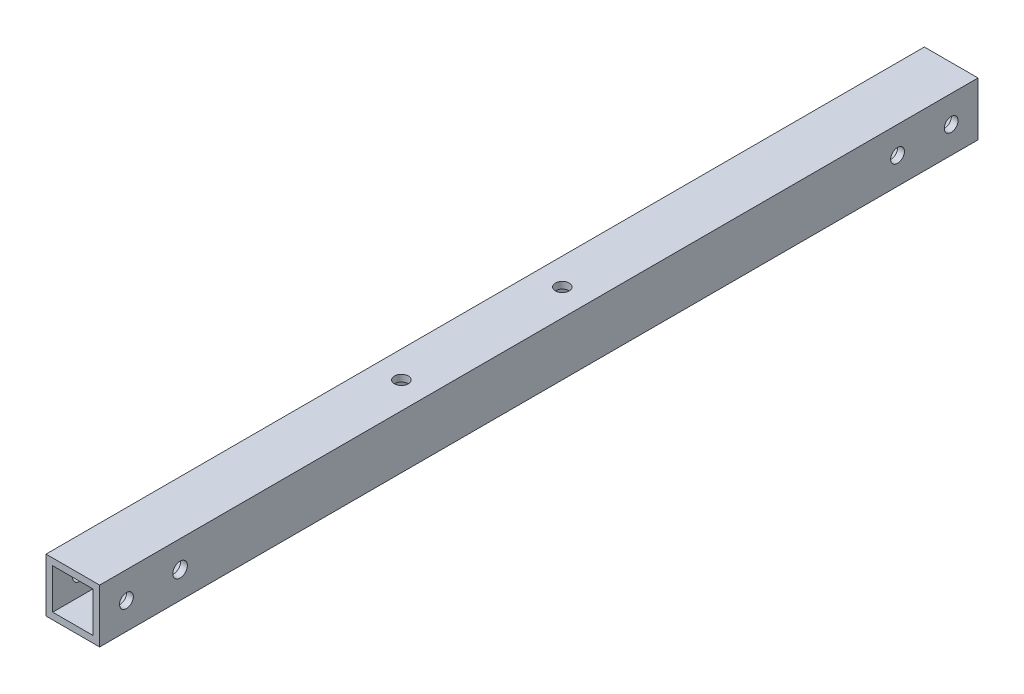
ISO-10303-21;
HEADER;
FILE_DESCRIPTION(('STEP AP214'),'2;1');
FILE_NAME('part.step','',(''),(''),'','','');
FILE_SCHEMA(('AUTOMOTIVE_DESIGN { 1 0 10303 214 1 1 1 1 }'));
ENDSEC;
DATA;
#1=APPLICATION_CONTEXT('core data for automotive mechanical design processes');
#2=APPLICATION_PROTOCOL_DEFINITION('international standard','automotive_design',2000,#1);
#3=PRODUCT_CONTEXT('',#1,'mechanical');
#4=PRODUCT('Part','Part','',(#3));
#5=PRODUCT_RELATED_PRODUCT_CATEGORY('part','',(#4));
#6=PRODUCT_DEFINITION_FORMATION('','',#4);
#7=PRODUCT_DEFINITION_CONTEXT('part definition',#1,'design');
#8=PRODUCT_DEFINITION('design','',#6,#7);
#9=PRODUCT_DEFINITION_SHAPE('','',#8);
#10=(LENGTH_UNIT() NAMED_UNIT(*) SI_UNIT(.MILLI.,.METRE.));
#11=(NAMED_UNIT(*) PLANE_ANGLE_UNIT() SI_UNIT($,.RADIAN.));
#12=(NAMED_UNIT(*) SI_UNIT($,.STERADIAN.) SOLID_ANGLE_UNIT());
#13=UNCERTAINTY_MEASURE_WITH_UNIT(LENGTH_MEASURE(1.E-05),#10,'distance_accuracy_value','');
#14=(GEOMETRIC_REPRESENTATION_CONTEXT(3) GLOBAL_UNCERTAINTY_ASSIGNED_CONTEXT((#13)) GLOBAL_UNIT_ASSIGNED_CONTEXT((#10,
#11,#12)) REPRESENTATION_CONTEXT('',''));
#15=CARTESIAN_POINT('',(0.,0.,0.));
#16=DIRECTION('',(0.,0.,1.));
#17=DIRECTION('',(1.,0.,0.));
#18=AXIS2_PLACEMENT_3D('',#15,#16,#17);
#19=CARTESIAN_POINT('',(0.,0.,415.925));
#20=DIRECTION('',(0.,0.,-1.));
#21=DIRECTION('',(-1.,0.,0.));
#22=AXIS2_PLACEMENT_3D('',#19,#20,#21);
#23=PLANE('',#22);
#24=DIRECTION('',(0.,1.,0.));
#25=VECTOR('',#24,1.);
#26=CARTESIAN_POINT('',(12.7,-12.7,415.925));
#27=LINE('',#26,#25);
#28=CARTESIAN_POINT('',(12.7,-12.7,415.925));
#29=VERTEX_POINT('',#28);
#30=CARTESIAN_POINT('',(12.7,12.7,415.925));
#31=VERTEX_POINT('',#30);
#32=EDGE_CURVE('E139',#29,#31,#27,.T.);
#33=ORIENTED_EDGE('',*,*,#32,.T.);
#34=DIRECTION('',(-1.,0.,0.));
#35=VECTOR('',#34,1.);
#36=CARTESIAN_POINT('',(-12.7,12.7,415.925));
#37=LINE('',#36,#35);
#38=CARTESIAN_POINT('',(-12.7,12.7,415.925));
#39=VERTEX_POINT('',#38);
#40=EDGE_CURVE('E142',#31,#39,#37,.T.);
#41=ORIENTED_EDGE('',*,*,#40,.T.);
#42=DIRECTION('',(0.,-1.,0.));
#43=VECTOR('',#42,1.);
#44=CARTESIAN_POINT('',(-12.7,-12.7,415.925));
#45=LINE('',#44,#43);
#46=CARTESIAN_POINT('',(-12.7,-12.7,415.925));
#47=VERTEX_POINT('',#46);
#48=EDGE_CURVE('E145',#39,#47,#45,.T.);
#49=ORIENTED_EDGE('',*,*,#48,.T.);
#50=DIRECTION('',(1.,0.,0.));
#51=VECTOR('',#50,1.);
#52=CARTESIAN_POINT('',(-12.7,-12.7,415.925));
#53=LINE('',#52,#51);
#54=EDGE_CURVE('E147',#47,#29,#53,.T.);
#55=ORIENTED_EDGE('',*,*,#54,.T.);
#56=EDGE_LOOP('',(#33,#41,#49,#55));
#57=FACE_BOUND('',#56,.T.);
#58=DIRECTION('',(0.,-1.,0.));
#59=VECTOR('',#58,1.);
#60=CARTESIAN_POINT('',(-9.525,-9.525,415.925));
#61=LINE('',#60,#59);
#62=CARTESIAN_POINT('',(-9.525,9.525,415.925));
#63=VERTEX_POINT('',#62);
#64=CARTESIAN_POINT('',(-9.525,-9.525,415.925));
#65=VERTEX_POINT('',#64);
#66=EDGE_CURVE('E101',#63,#65,#61,.T.);
#67=ORIENTED_EDGE('',*,*,#66,.F.);
#68=DIRECTION('',(-1.,0.,0.));
#69=VECTOR('',#68,1.);
#70=CARTESIAN_POINT('',(-9.525,9.525,415.925));
#71=LINE('',#70,#69);
#72=CARTESIAN_POINT('',(9.525,9.525,415.925));
#73=VERTEX_POINT('',#72);
#74=EDGE_CURVE('E123',#73,#63,#71,.T.);
#75=ORIENTED_EDGE('',*,*,#74,.F.);
#76=DIRECTION('',(0.,1.,0.));
#77=VECTOR('',#76,1.);
#78=CARTESIAN_POINT('',(9.525,-9.525,415.925));
#79=LINE('',#78,#77);
#80=CARTESIAN_POINT('',(9.525,-9.525,415.925));
#81=VERTEX_POINT('',#80);
#82=EDGE_CURVE('E121',#81,#73,#79,.T.);
#83=ORIENTED_EDGE('',*,*,#82,.F.);
#84=DIRECTION('',(1.,0.,0.));
#85=VECTOR('',#84,1.);
#86=CARTESIAN_POINT('',(-9.525,-9.525,415.925));
#87=LINE('',#86,#85);
#88=EDGE_CURVE('E109',#65,#81,#87,.T.);
#89=ORIENTED_EDGE('',*,*,#88,.F.);
#90=EDGE_LOOP('',(#67,#75,#83,#89));
#91=FACE_BOUND('',#90,.T.);
#92=ADVANCED_FACE('F34',(#57,#91),#23,.F.);
#93=CARTESIAN_POINT('',(0.,0.,0.));
#94=DIRECTION('',(0.,0.,-1.));
#95=DIRECTION('',(-1.,0.,0.));
#96=AXIS2_PLACEMENT_3D('',#93,#94,#95);
#97=PLANE('',#96);
#98=DIRECTION('',(0.,1.,0.));
#99=VECTOR('',#98,1.);
#100=CARTESIAN_POINT('',(12.7,-12.7,0.));
#101=LINE('',#100,#99);
#102=CARTESIAN_POINT('',(12.7,-12.7,0.));
#103=VERTEX_POINT('',#102);
#104=CARTESIAN_POINT('',(12.7,12.7,0.));
#105=VERTEX_POINT('',#104);
#106=EDGE_CURVE('E117',#103,#105,#101,.T.);
#107=ORIENTED_EDGE('',*,*,#106,.F.);
#108=DIRECTION('',(1.,0.,0.));
#109=VECTOR('',#108,1.);
#110=CARTESIAN_POINT('',(-12.7,-12.7,0.));
#111=LINE('',#110,#109);
#112=CARTESIAN_POINT('',(-12.7,-12.7,0.));
#113=VERTEX_POINT('',#112);
#114=EDGE_CURVE('E143',#113,#103,#111,.T.);
#115=ORIENTED_EDGE('',*,*,#114,.F.);
#116=DIRECTION('',(0.,-1.,0.));
#117=VECTOR('',#116,1.);
#118=CARTESIAN_POINT('',(-12.7,-12.7,0.));
#119=LINE('',#118,#117);
#120=CARTESIAN_POINT('',(-12.7,12.7,0.));
#121=VERTEX_POINT('',#120);
#122=EDGE_CURVE('E154',#121,#113,#119,.T.);
#123=ORIENTED_EDGE('',*,*,#122,.F.);
#124=DIRECTION('',(-1.,0.,0.));
#125=VECTOR('',#124,1.);
#126=CARTESIAN_POINT('',(-12.7,12.7,0.));
#127=LINE('',#126,#125);
#128=EDGE_CURVE('E152',#105,#121,#127,.T.);
#129=ORIENTED_EDGE('',*,*,#128,.F.);
#130=EDGE_LOOP('',(#107,#115,#123,#129));
#131=FACE_BOUND('',#130,.T.);
#132=DIRECTION('',(-1.,0.,0.));
#133=VECTOR('',#132,1.);
#134=CARTESIAN_POINT('',(-9.525,9.525,0.));
#135=LINE('',#134,#133);
#136=CARTESIAN_POINT('',(9.525,9.525,0.));
#137=VERTEX_POINT('',#136);
#138=CARTESIAN_POINT('',(-9.525,9.525,0.));
#139=VERTEX_POINT('',#138);
#140=EDGE_CURVE('E110',#137,#139,#135,.T.);
#141=ORIENTED_EDGE('',*,*,#140,.T.);
#142=DIRECTION('',(0.,-1.,0.));
#143=VECTOR('',#142,1.);
#144=CARTESIAN_POINT('',(-9.525,-9.525,0.));
#145=LINE('',#144,#143);
#146=CARTESIAN_POINT('',(-9.525,-9.525,0.));
#147=VERTEX_POINT('',#146);
#148=EDGE_CURVE('E59',#139,#147,#145,.T.);
#149=ORIENTED_EDGE('',*,*,#148,.T.);
#150=DIRECTION('',(1.,0.,0.));
#151=VECTOR('',#150,1.);
#152=CARTESIAN_POINT('',(-9.525,-9.525,0.));
#153=LINE('',#152,#151);
#154=CARTESIAN_POINT('',(9.525,-9.525,0.));
#155=VERTEX_POINT('',#154);
#156=EDGE_CURVE('E116',#147,#155,#153,.T.);
#157=ORIENTED_EDGE('',*,*,#156,.T.);
#158=DIRECTION('',(0.,1.,0.));
#159=VECTOR('',#158,1.);
#160=CARTESIAN_POINT('',(9.525,-9.525,0.));
#161=LINE('',#160,#159);
#162=EDGE_CURVE('E131',#155,#137,#161,.T.);
#163=ORIENTED_EDGE('',*,*,#162,.T.);
#164=EDGE_LOOP('',(#141,#149,#157,#163));
#165=FACE_BOUND('',#164,.T.);
#166=ADVANCED_FACE('F237',(#131,#165),#97,.T.);
#167=CARTESIAN_POINT('',(12.7,-12.7,415.925));
#168=DIRECTION('',(-1.,0.,0.));
#169=DIRECTION('',(0.,0.,1.));
#170=AXIS2_PLACEMENT_3D('',#167,#168,#169);
#171=PLANE('',#170);
#172=CARTESIAN_POINT('',(12.7,0.,377.825));
#173=DIRECTION('',(1.,0.,0.));
#174=DIRECTION('',(0.,0.,-1.));
#175=AXIS2_PLACEMENT_3D('',#172,#173,#174);
#176=CIRCLE('',#175,3.4544);
#177=CARTESIAN_POINT('',(12.7,0.,374.3706));
#178=VERTEX_POINT('',#177);
#179=EDGE_CURVE('E187',#178,#178,#176,.T.);
#180=ORIENTED_EDGE('',*,*,#179,.F.);
#181=EDGE_LOOP('',(#180));
#182=FACE_BOUND('',#181,.T.);
#183=CARTESIAN_POINT('',(12.7,0.,403.225));
#184=DIRECTION('',(1.,0.,0.));
#185=DIRECTION('',(0.,0.,-1.));
#186=AXIS2_PLACEMENT_3D('',#183,#184,#185);
#187=CIRCLE('',#186,3.26389999999999);
#188=CARTESIAN_POINT('',(12.7,0.,399.9611));
#189=VERTEX_POINT('',#188);
#190=EDGE_CURVE('E184',#189,#189,#187,.T.);
#191=ORIENTED_EDGE('',*,*,#190,.F.);
#192=EDGE_LOOP('',(#191));
#193=FACE_BOUND('',#192,.T.);
#194=CARTESIAN_POINT('',(12.7,0.,12.7));
#195=DIRECTION('',(1.,0.,0.));
#196=DIRECTION('',(0.,0.,-1.));
#197=AXIS2_PLACEMENT_3D('',#194,#195,#196);
#198=CIRCLE('',#197,3.26389999999999);
#199=CARTESIAN_POINT('',(12.7,0.,9.43610000000001));
#200=VERTEX_POINT('',#199);
#201=EDGE_CURVE('E202',#200,#200,#198,.T.);
#202=ORIENTED_EDGE('',*,*,#201,.F.);
#203=EDGE_LOOP('',(#202));
#204=FACE_BOUND('',#203,.T.);
#205=CARTESIAN_POINT('',(12.7,0.,38.1));
#206=DIRECTION('',(1.,0.,0.));
#207=DIRECTION('',(0.,0.,-1.));
#208=AXIS2_PLACEMENT_3D('',#205,#206,#207);
#209=CIRCLE('',#208,3.26389999999999);
#210=CARTESIAN_POINT('',(12.7,0.,34.8361));
#211=VERTEX_POINT('',#210);
#212=EDGE_CURVE('E209',#211,#211,#209,.T.);
#213=ORIENTED_EDGE('',*,*,#212,.F.);
#214=EDGE_LOOP('',(#213));
#215=FACE_BOUND('',#214,.T.);
#216=ORIENTED_EDGE('',*,*,#106,.T.);
#217=DIRECTION('',(0.,0.,-1.));
#218=VECTOR('',#217,1.);
#219=CARTESIAN_POINT('',(12.7,12.7,415.925));
#220=LINE('',#219,#218);
#221=EDGE_CURVE('E11',#31,#105,#220,.T.);
#222=ORIENTED_EDGE('',*,*,#221,.F.);
#223=ORIENTED_EDGE('',*,*,#32,.F.);
#224=DIRECTION('',(0.,0.,-1.));
#225=VECTOR('',#224,1.);
#226=CARTESIAN_POINT('',(12.7,-12.7,415.925));
#227=LINE('',#226,#225);
#228=EDGE_CURVE('E149',#29,#103,#227,.T.);
#229=ORIENTED_EDGE('',*,*,#228,.T.);
#230=EDGE_LOOP('',(#216,#222,#223,#229));
#231=FACE_BOUND('',#230,.T.);
#232=ADVANCED_FACE('F36',(#182,#193,#204,#215,#231),#171,.F.);
#233=CARTESIAN_POINT('',(-12.7,12.7,415.925));
#234=DIRECTION('',(0.,-1.,0.));
#235=DIRECTION('',(0.,0.,-1.));
#236=AXIS2_PLACEMENT_3D('',#233,#234,#235);
#237=PLANE('',#236);
#238=CARTESIAN_POINT('',(0.,12.7,184.15));
#239=DIRECTION('',(0.,1.,0.));
#240=DIRECTION('',(0.,0.,1.));
#241=AXIS2_PLACEMENT_3D('',#238,#239,#240);
#242=CIRCLE('',#241,3.2639);
#243=CARTESIAN_POINT('',(0.,12.7,187.4139));
#244=VERTEX_POINT('',#243);
#245=EDGE_CURVE('E256',#244,#244,#242,.T.);
#246=ORIENTED_EDGE('',*,*,#245,.F.);
#247=EDGE_LOOP('',(#246));
#248=FACE_BOUND('',#247,.T.);
#249=CARTESIAN_POINT('',(0.,12.7,260.35));
#250=DIRECTION('',(0.,1.,0.));
#251=DIRECTION('',(0.,0.,1.));
#252=AXIS2_PLACEMENT_3D('',#249,#250,#251);
#253=CIRCLE('',#252,3.2639);
#254=CARTESIAN_POINT('',(0.,12.7,263.6139));
#255=VERTEX_POINT('',#254);
#256=EDGE_CURVE('E260',#255,#255,#253,.T.);
#257=ORIENTED_EDGE('',*,*,#256,.F.);
#258=EDGE_LOOP('',(#257));
#259=FACE_BOUND('',#258,.T.);
#260=ORIENTED_EDGE('',*,*,#128,.T.);
#261=DIRECTION('',(0.,0.,-1.));
#262=VECTOR('',#261,1.);
#263=CARTESIAN_POINT('',(-12.7,12.7,415.925));
#264=LINE('',#263,#262);
#265=EDGE_CURVE('E43',#39,#121,#264,.T.);
#266=ORIENTED_EDGE('',*,*,#265,.F.);
#267=ORIENTED_EDGE('',*,*,#40,.F.);
#268=ORIENTED_EDGE('',*,*,#221,.T.);
#269=EDGE_LOOP('',(#260,#266,#267,#268));
#270=FACE_BOUND('',#269,.T.);
#271=ADVANCED_FACE('F246',(#248,#259,#270),#237,.F.);
#272=CARTESIAN_POINT('',(-12.7,-12.7,415.925));
#273=DIRECTION('',(1.,0.,0.));
#274=DIRECTION('',(0.,0.,-1.));
#275=AXIS2_PLACEMENT_3D('',#272,#273,#274);
#276=PLANE('',#275);
#277=CARTESIAN_POINT('',(-12.7,0.,377.825));
#278=DIRECTION('',(1.,0.,0.));
#279=DIRECTION('',(0.,0.,-1.));
#280=AXIS2_PLACEMENT_3D('',#277,#278,#279);
#281=CIRCLE('',#280,3.45439999999999);
#282=CARTESIAN_POINT('',(-12.7,0.,374.3706));
#283=VERTEX_POINT('',#282);
#284=EDGE_CURVE('E180',#283,#283,#281,.T.);
#285=ORIENTED_EDGE('',*,*,#284,.T.);
#286=EDGE_LOOP('',(#285));
#287=FACE_BOUND('',#286,.T.);
#288=CARTESIAN_POINT('',(-12.7,0.,403.225));
#289=DIRECTION('',(1.,0.,0.));
#290=DIRECTION('',(0.,0.,-1.));
#291=AXIS2_PLACEMENT_3D('',#288,#289,#290);
#292=CIRCLE('',#291,3.26389999999998);
#293=CARTESIAN_POINT('',(-12.7,0.,399.9611));
#294=VERTEX_POINT('',#293);
#295=EDGE_CURVE('E176',#294,#294,#292,.T.);
#296=ORIENTED_EDGE('',*,*,#295,.T.);
#297=EDGE_LOOP('',(#296));
#298=FACE_BOUND('',#297,.T.);
#299=CARTESIAN_POINT('',(-12.7,0.,12.7));
#300=DIRECTION('',(1.,0.,0.));
#301=DIRECTION('',(0.,0.,-1.));
#302=AXIS2_PLACEMENT_3D('',#299,#300,#301);
#303=CIRCLE('',#302,3.26389999999998);
#304=CARTESIAN_POINT('',(-12.7,0.,9.43610000000002));
#305=VERTEX_POINT('',#304);
#306=EDGE_CURVE('E172',#305,#305,#303,.T.);
#307=ORIENTED_EDGE('',*,*,#306,.T.);
#308=EDGE_LOOP('',(#307));
#309=FACE_BOUND('',#308,.T.);
#310=CARTESIAN_POINT('',(-12.7,0.,38.1));
#311=DIRECTION('',(1.,0.,0.));
#312=DIRECTION('',(0.,0.,-1.));
#313=AXIS2_PLACEMENT_3D('',#310,#311,#312);
#314=CIRCLE('',#313,3.26389999999998);
#315=CARTESIAN_POINT('',(-12.7,0.,34.8361));
#316=VERTEX_POINT('',#315);
#317=EDGE_CURVE('E167',#316,#316,#314,.T.);
#318=ORIENTED_EDGE('',*,*,#317,.T.);
#319=EDGE_LOOP('',(#318));
#320=FACE_BOUND('',#319,.T.);
#321=ORIENTED_EDGE('',*,*,#122,.T.);
#322=DIRECTION('',(0.,0.,-1.));
#323=VECTOR('',#322,1.);
#324=CARTESIAN_POINT('',(-12.7,-12.7,415.925));
#325=LINE('',#324,#323);
#326=EDGE_CURVE('E159',#47,#113,#325,.T.);
#327=ORIENTED_EDGE('',*,*,#326,.F.);
#328=ORIENTED_EDGE('',*,*,#48,.F.);
#329=ORIENTED_EDGE('',*,*,#265,.T.);
#330=EDGE_LOOP('',(#321,#327,#328,#329));
#331=FACE_BOUND('',#330,.T.);
#332=ADVANCED_FACE('F230',(#287,#298,#309,#320,#331),#276,.F.);
#333=CARTESIAN_POINT('',(-12.7,-12.7,415.925));
#334=DIRECTION('',(0.,1.,0.));
#335=DIRECTION('',(0.,0.,1.));
#336=AXIS2_PLACEMENT_3D('',#333,#334,#335);
#337=PLANE('',#336);
#338=CARTESIAN_POINT('',(0.,-12.7,184.15));
#339=DIRECTION('',(0.,1.,0.));
#340=DIRECTION('',(0.,0.,1.));
#341=AXIS2_PLACEMENT_3D('',#338,#339,#340);
#342=CIRCLE('',#341,3.26389999999999);
#343=CARTESIAN_POINT('',(0.,-12.7,187.4139));
#344=VERTEX_POINT('',#343);
#345=EDGE_CURVE('E321',#344,#344,#342,.T.);
#346=ORIENTED_EDGE('',*,*,#345,.T.);
#347=EDGE_LOOP('',(#346));
#348=FACE_BOUND('',#347,.T.);
#349=CARTESIAN_POINT('',(0.,-12.7,260.35));
#350=DIRECTION('',(0.,1.,0.));
#351=DIRECTION('',(0.,0.,1.));
#352=AXIS2_PLACEMENT_3D('',#349,#350,#351);
#353=CIRCLE('',#352,3.26389999999999);
#354=CARTESIAN_POINT('',(0.,-12.7,263.6139));
#355=VERTEX_POINT('',#354);
#356=EDGE_CURVE('E330',#355,#355,#353,.T.);
#357=ORIENTED_EDGE('',*,*,#356,.T.);
#358=EDGE_LOOP('',(#357));
#359=FACE_BOUND('',#358,.T.);
#360=ORIENTED_EDGE('',*,*,#114,.T.);
#361=ORIENTED_EDGE('',*,*,#228,.F.);
#362=ORIENTED_EDGE('',*,*,#54,.F.);
#363=ORIENTED_EDGE('',*,*,#326,.T.);
#364=EDGE_LOOP('',(#360,#361,#362,#363));
#365=FACE_BOUND('',#364,.T.);
#366=ADVANCED_FACE('F220',(#348,#359,#365),#337,.F.);
#367=CARTESIAN_POINT('',(-9.525,-9.525,415.925));
#368=DIRECTION('',(1.,0.,0.));
#369=DIRECTION('',(0.,0.,-1.));
#370=AXIS2_PLACEMENT_3D('',#367,#368,#369);
#371=PLANE('',#370);
#372=CARTESIAN_POINT('',(-9.525,0.,377.825));
#373=DIRECTION('',(1.,0.,0.));
#374=DIRECTION('',(0.,0.,-1.));
#375=AXIS2_PLACEMENT_3D('',#372,#373,#374);
#376=CIRCLE('',#375,3.4544);
#377=CARTESIAN_POINT('',(-9.525,0.,374.3706));
#378=VERTEX_POINT('',#377);
#379=EDGE_CURVE('E179',#378,#378,#376,.T.);
#380=ORIENTED_EDGE('',*,*,#379,.F.);
#381=EDGE_LOOP('',(#380));
#382=FACE_BOUND('',#381,.T.);
#383=CARTESIAN_POINT('',(-9.525,0.,403.225));
#384=DIRECTION('',(1.,0.,0.));
#385=DIRECTION('',(0.,0.,-1.));
#386=AXIS2_PLACEMENT_3D('',#383,#384,#385);
#387=CIRCLE('',#386,3.26389999999999);
#388=CARTESIAN_POINT('',(-9.525,0.,399.9611));
#389=VERTEX_POINT('',#388);
#390=EDGE_CURVE('E175',#389,#389,#387,.T.);
#391=ORIENTED_EDGE('',*,*,#390,.F.);
#392=EDGE_LOOP('',(#391));
#393=FACE_BOUND('',#392,.T.);
#394=CARTESIAN_POINT('',(-9.525,0.,12.7));
#395=DIRECTION('',(1.,0.,0.));
#396=DIRECTION('',(0.,0.,-1.));
#397=AXIS2_PLACEMENT_3D('',#394,#395,#396);
#398=CIRCLE('',#397,3.26389999999999);
#399=CARTESIAN_POINT('',(-9.525,0.,9.43610000000001));
#400=VERTEX_POINT('',#399);
#401=EDGE_CURVE('E171',#400,#400,#398,.T.);
#402=ORIENTED_EDGE('',*,*,#401,.F.);
#403=EDGE_LOOP('',(#402));
#404=FACE_BOUND('',#403,.T.);
#405=CARTESIAN_POINT('',(-9.525,0.,38.1));
#406=DIRECTION('',(1.,0.,0.));
#407=DIRECTION('',(0.,0.,-1.));
#408=AXIS2_PLACEMENT_3D('',#405,#406,#407);
#409=CIRCLE('',#408,3.26389999999999);
#410=CARTESIAN_POINT('',(-9.525,0.,34.8361));
#411=VERTEX_POINT('',#410);
#412=EDGE_CURVE('E129',#411,#411,#409,.T.);
#413=ORIENTED_EDGE('',*,*,#412,.F.);
#414=EDGE_LOOP('',(#413));
#415=FACE_BOUND('',#414,.T.);
#416=ORIENTED_EDGE('',*,*,#148,.F.);
#417=DIRECTION('',(0.,0.,-1.));
#418=VECTOR('',#417,1.);
#419=CARTESIAN_POINT('',(-9.525,9.525,415.925));
#420=LINE('',#419,#418);
#421=EDGE_CURVE('E105',#63,#139,#420,.T.);
#422=ORIENTED_EDGE('',*,*,#421,.F.);
#423=ORIENTED_EDGE('',*,*,#66,.T.);
#424=DIRECTION('',(0.,0.,-1.));
#425=VECTOR('',#424,1.);
#426=CARTESIAN_POINT('',(-9.525,-9.525,415.925));
#427=LINE('',#426,#425);
#428=EDGE_CURVE('E104',#65,#147,#427,.T.);
#429=ORIENTED_EDGE('',*,*,#428,.T.);
#430=EDGE_LOOP('',(#416,#422,#423,#429));
#431=FACE_BOUND('',#430,.T.);
#432=ADVANCED_FACE('F103',(#382,#393,#404,#415,#431),#371,.T.);
#433=CARTESIAN_POINT('',(-9.525,-9.525,415.925));
#434=DIRECTION('',(0.,1.,0.));
#435=DIRECTION('',(0.,0.,1.));
#436=AXIS2_PLACEMENT_3D('',#433,#434,#435);
#437=PLANE('',#436);
#438=CARTESIAN_POINT('',(0.,-9.525,184.15));
#439=DIRECTION('',(0.,1.,0.));
#440=DIRECTION('',(0.,0.,1.));
#441=AXIS2_PLACEMENT_3D('',#438,#439,#440);
#442=CIRCLE('',#441,3.2639);
#443=CARTESIAN_POINT('',(0.,-9.525,187.4139));
#444=VERTEX_POINT('',#443);
#445=EDGE_CURVE('E326',#444,#444,#442,.T.);
#446=ORIENTED_EDGE('',*,*,#445,.F.);
#447=EDGE_LOOP('',(#446));
#448=FACE_BOUND('',#447,.T.);
#449=CARTESIAN_POINT('',(0.,-9.525,260.35));
#450=DIRECTION('',(0.,1.,0.));
#451=DIRECTION('',(0.,0.,1.));
#452=AXIS2_PLACEMENT_3D('',#449,#450,#451);
#453=CIRCLE('',#452,3.2639);
#454=CARTESIAN_POINT('',(0.,-9.525,263.6139));
#455=VERTEX_POINT('',#454);
#456=EDGE_CURVE('E333',#455,#455,#453,.T.);
#457=ORIENTED_EDGE('',*,*,#456,.F.);
#458=EDGE_LOOP('',(#457));
#459=FACE_BOUND('',#458,.T.);
#460=ORIENTED_EDGE('',*,*,#156,.F.);
#461=ORIENTED_EDGE('',*,*,#428,.F.);
#462=ORIENTED_EDGE('',*,*,#88,.T.);
#463=DIRECTION('',(0.,0.,-1.));
#464=VECTOR('',#463,1.);
#465=CARTESIAN_POINT('',(9.525,-9.525,415.925));
#466=LINE('',#465,#464);
#467=EDGE_CURVE('E118',#81,#155,#466,.T.);
#468=ORIENTED_EDGE('',*,*,#467,.T.);
#469=EDGE_LOOP('',(#460,#461,#462,#468));
#470=FACE_BOUND('',#469,.T.);
#471=ADVANCED_FACE('F113',(#448,#459,#470),#437,.T.);
#472=CARTESIAN_POINT('',(9.525,-9.525,415.925));
#473=DIRECTION('',(-1.,0.,0.));
#474=DIRECTION('',(0.,-1.,0.));
#475=AXIS2_PLACEMENT_3D('',#472,#473,#474);
#476=PLANE('',#475);
#477=CARTESIAN_POINT('',(9.525,0.,377.825));
#478=DIRECTION('',(-1.,0.,0.));
#479=DIRECTION('',(0.,-1.,0.));
#480=AXIS2_PLACEMENT_3D('',#477,#478,#479);
#481=CIRCLE('',#480,3.4544);
#482=CARTESIAN_POINT('',(9.525,-3.4544,377.825));
#483=VERTEX_POINT('',#482);
#484=EDGE_CURVE('E177',#483,#483,#481,.T.);
#485=ORIENTED_EDGE('',*,*,#484,.F.);
#486=EDGE_LOOP('',(#485));
#487=FACE_BOUND('',#486,.T.);
#488=CARTESIAN_POINT('',(9.525,0.,403.225));
#489=DIRECTION('',(-1.,0.,0.));
#490=DIRECTION('',(0.,-1.,0.));
#491=AXIS2_PLACEMENT_3D('',#488,#489,#490);
#492=CIRCLE('',#491,3.26389999999999);
#493=CARTESIAN_POINT('',(9.525,-3.26389999999999,403.225));
#494=VERTEX_POINT('',#493);
#495=EDGE_CURVE('E173',#494,#494,#492,.T.);
#496=ORIENTED_EDGE('',*,*,#495,.F.);
#497=EDGE_LOOP('',(#496));
#498=FACE_BOUND('',#497,.T.);
#499=CARTESIAN_POINT('',(9.525,0.,12.7));
#500=DIRECTION('',(-1.,0.,0.));
#501=DIRECTION('',(0.,-1.,0.));
#502=AXIS2_PLACEMENT_3D('',#499,#500,#501);
#503=CIRCLE('',#502,3.26389999999999);
#504=CARTESIAN_POINT('',(9.525,-3.26389999999999,12.7));
#505=VERTEX_POINT('',#504);
#506=EDGE_CURVE('E168',#505,#505,#503,.T.);
#507=ORIENTED_EDGE('',*,*,#506,.F.);
#508=EDGE_LOOP('',(#507));
#509=FACE_BOUND('',#508,.T.);
#510=CARTESIAN_POINT('',(9.525,0.,38.1));
#511=DIRECTION('',(-1.,0.,0.));
#512=DIRECTION('',(0.,-1.,0.));
#513=AXIS2_PLACEMENT_3D('',#510,#511,#512);
#514=CIRCLE('',#513,3.26389999999999);
#515=CARTESIAN_POINT('',(9.525,-3.26389999999999,38.1));
#516=VERTEX_POINT('',#515);
#517=EDGE_CURVE('E164',#516,#516,#514,.T.);
#518=ORIENTED_EDGE('',*,*,#517,.F.);
#519=EDGE_LOOP('',(#518));
#520=FACE_BOUND('',#519,.T.);
#521=ORIENTED_EDGE('',*,*,#162,.F.);
#522=ORIENTED_EDGE('',*,*,#467,.F.);
#523=ORIENTED_EDGE('',*,*,#82,.T.);
#524=DIRECTION('',(0.,0.,-1.));
#525=VECTOR('',#524,1.);
#526=CARTESIAN_POINT('',(9.525,9.525,415.925));
#527=LINE('',#526,#525);
#528=EDGE_CURVE('E51',#73,#137,#527,.T.);
#529=ORIENTED_EDGE('',*,*,#528,.T.);
#530=EDGE_LOOP('',(#521,#522,#523,#529));
#531=FACE_BOUND('',#530,.T.);
#532=ADVANCED_FACE('F227',(#487,#498,#509,#520,#531),#476,.T.);
#533=CARTESIAN_POINT('',(-9.525,9.525,415.925));
#534=DIRECTION('',(0.,-1.,0.));
#535=DIRECTION('',(1.,0.,0.));
#536=AXIS2_PLACEMENT_3D('',#533,#534,#535);
#537=PLANE('',#536);
#538=CARTESIAN_POINT('',(0.,9.525,184.15));
#539=DIRECTION('',(0.,-1.,0.));
#540=DIRECTION('',(1.,0.,0.));
#541=AXIS2_PLACEMENT_3D('',#538,#539,#540);
#542=CIRCLE('',#541,3.2639);
#543=CARTESIAN_POINT('',(3.2639,9.525,184.15));
#544=VERTEX_POINT('',#543);
#545=EDGE_CURVE('E38',#544,#544,#542,.T.);
#546=ORIENTED_EDGE('',*,*,#545,.F.);
#547=EDGE_LOOP('',(#546));
#548=FACE_BOUND('',#547,.T.);
#549=CARTESIAN_POINT('',(0.,9.525,260.35));
#550=DIRECTION('',(0.,-1.,0.));
#551=DIRECTION('',(1.,0.,0.));
#552=AXIS2_PLACEMENT_3D('',#549,#550,#551);
#553=CIRCLE('',#552,3.2639);
#554=CARTESIAN_POINT('',(3.2639,9.525,260.35));
#555=VERTEX_POINT('',#554);
#556=EDGE_CURVE('E192',#555,#555,#553,.T.);
#557=ORIENTED_EDGE('',*,*,#556,.F.);
#558=EDGE_LOOP('',(#557));
#559=FACE_BOUND('',#558,.T.);
#560=ORIENTED_EDGE('',*,*,#140,.F.);
#561=ORIENTED_EDGE('',*,*,#528,.F.);
#562=ORIENTED_EDGE('',*,*,#74,.T.);
#563=ORIENTED_EDGE('',*,*,#421,.T.);
#564=EDGE_LOOP('',(#560,#561,#562,#563));
#565=FACE_BOUND('',#564,.T.);
#566=ADVANCED_FACE('F276',(#548,#559,#565),#537,.T.);
#567=CARTESIAN_POINT('',(12.7,0.,38.1));
#568=DIRECTION('',(1.,0.,0.));
#569=DIRECTION('',(0.,0.,-1.));
#570=AXIS2_PLACEMENT_3D('',#567,#568,#569);
#571=CYLINDRICAL_SURFACE('',#570,3.26389999999999);
#572=ORIENTED_EDGE('',*,*,#517,.T.);
#573=EDGE_LOOP('',(#572));
#574=FACE_BOUND('',#573,.T.);
#575=ORIENTED_EDGE('',*,*,#212,.T.);
#576=EDGE_LOOP('',(#575));
#577=FACE_BOUND('',#576,.T.);
#578=ADVANCED_FACE('F278',(#574,#577),#571,.F.);
#579=ORIENTED_EDGE('',*,*,#412,.T.);
#580=EDGE_LOOP('',(#579));
#581=FACE_BOUND('',#580,.T.);
#582=ORIENTED_EDGE('',*,*,#317,.F.);
#583=EDGE_LOOP('',(#582));
#584=FACE_BOUND('',#583,.T.);
#585=ADVANCED_FACE('F216',(#581,#584),#571,.F.);
#586=CARTESIAN_POINT('',(12.7,0.,12.7));
#587=DIRECTION('',(1.,0.,0.));
#588=DIRECTION('',(0.,0.,-1.));
#589=AXIS2_PLACEMENT_3D('',#586,#587,#588);
#590=CYLINDRICAL_SURFACE('',#589,3.26389999999999);
#591=ORIENTED_EDGE('',*,*,#506,.T.);
#592=EDGE_LOOP('',(#591));
#593=FACE_BOUND('',#592,.T.);
#594=ORIENTED_EDGE('',*,*,#201,.T.);
#595=EDGE_LOOP('',(#594));
#596=FACE_BOUND('',#595,.T.);
#597=ADVANCED_FACE('F292',(#593,#596),#590,.F.);
#598=ORIENTED_EDGE('',*,*,#401,.T.);
#599=EDGE_LOOP('',(#598));
#600=FACE_BOUND('',#599,.T.);
#601=ORIENTED_EDGE('',*,*,#306,.F.);
#602=EDGE_LOOP('',(#601));
#603=FACE_BOUND('',#602,.T.);
#604=ADVANCED_FACE('F295',(#600,#603),#590,.F.);
#605=CARTESIAN_POINT('',(12.7,0.,403.225));
#606=DIRECTION('',(1.,0.,0.));
#607=DIRECTION('',(0.,0.,-1.));
#608=AXIS2_PLACEMENT_3D('',#605,#606,#607);
#609=CYLINDRICAL_SURFACE('',#608,3.26389999999999);
#610=ORIENTED_EDGE('',*,*,#495,.T.);
#611=EDGE_LOOP('',(#610));
#612=FACE_BOUND('',#611,.T.);
#613=ORIENTED_EDGE('',*,*,#190,.T.);
#614=EDGE_LOOP('',(#613));
#615=FACE_BOUND('',#614,.T.);
#616=ADVANCED_FACE('F297',(#612,#615),#609,.F.);
#617=ORIENTED_EDGE('',*,*,#390,.T.);
#618=EDGE_LOOP('',(#617));
#619=FACE_BOUND('',#618,.T.);
#620=ORIENTED_EDGE('',*,*,#295,.F.);
#621=EDGE_LOOP('',(#620));
#622=FACE_BOUND('',#621,.T.);
#623=ADVANCED_FACE('F300',(#619,#622),#609,.F.);
#624=CARTESIAN_POINT('',(12.7,0.,377.825));
#625=DIRECTION('',(1.,0.,0.));
#626=DIRECTION('',(0.,0.,-1.));
#627=AXIS2_PLACEMENT_3D('',#624,#625,#626);
#628=CYLINDRICAL_SURFACE('',#627,3.4544);
#629=ORIENTED_EDGE('',*,*,#484,.T.);
#630=EDGE_LOOP('',(#629));
#631=FACE_BOUND('',#630,.T.);
#632=ORIENTED_EDGE('',*,*,#179,.T.);
#633=EDGE_LOOP('',(#632));
#634=FACE_BOUND('',#633,.T.);
#635=ADVANCED_FACE('F302',(#631,#634),#628,.F.);
#636=ORIENTED_EDGE('',*,*,#379,.T.);
#637=EDGE_LOOP('',(#636));
#638=FACE_BOUND('',#637,.T.);
#639=ORIENTED_EDGE('',*,*,#284,.F.);
#640=EDGE_LOOP('',(#639));
#641=FACE_BOUND('',#640,.T.);
#642=ADVANCED_FACE('F305',(#638,#641),#628,.F.);
#643=CARTESIAN_POINT('',(0.,12.7,260.35));
#644=DIRECTION('',(0.,1.,0.));
#645=DIRECTION('',(0.,0.,1.));
#646=AXIS2_PLACEMENT_3D('',#643,#644,#645);
#647=CYLINDRICAL_SURFACE('',#646,3.2639);
#648=ORIENTED_EDGE('',*,*,#556,.T.);
#649=EDGE_LOOP('',(#648));
#650=FACE_BOUND('',#649,.T.);
#651=ORIENTED_EDGE('',*,*,#256,.T.);
#652=EDGE_LOOP('',(#651));
#653=FACE_BOUND('',#652,.T.);
#654=ADVANCED_FACE('F310',(#650,#653),#647,.F.);
#655=ORIENTED_EDGE('',*,*,#456,.T.);
#656=EDGE_LOOP('',(#655));
#657=FACE_BOUND('',#656,.T.);
#658=ORIENTED_EDGE('',*,*,#356,.F.);
#659=EDGE_LOOP('',(#658));
#660=FACE_BOUND('',#659,.T.);
#661=ADVANCED_FACE('F306',(#657,#660),#647,.F.);
#662=CARTESIAN_POINT('',(0.,12.7,184.15));
#663=DIRECTION('',(0.,1.,0.));
#664=DIRECTION('',(0.,0.,1.));
#665=AXIS2_PLACEMENT_3D('',#662,#663,#664);
#666=CYLINDRICAL_SURFACE('',#665,3.2639);
#667=ORIENTED_EDGE('',*,*,#545,.T.);
#668=EDGE_LOOP('',(#667));
#669=FACE_BOUND('',#668,.T.);
#670=ORIENTED_EDGE('',*,*,#245,.T.);
#671=EDGE_LOOP('',(#670));
#672=FACE_BOUND('',#671,.T.);
#673=ADVANCED_FACE('F309',(#669,#672),#666,.F.);
#674=ORIENTED_EDGE('',*,*,#445,.T.);
#675=EDGE_LOOP('',(#674));
#676=FACE_BOUND('',#675,.T.);
#677=ORIENTED_EDGE('',*,*,#345,.F.);
#678=EDGE_LOOP('',(#677));
#679=FACE_BOUND('',#678,.T.);
#680=ADVANCED_FACE('F313',(#676,#679),#666,.F.);
#681=CLOSED_SHELL('',(#92,#166,#232,#271,#332,#366,#432,#471,#532,#566,#578,#585,#597,#604,#616,
#623,#635,#642,#654,#661,#673,#680));
#682=MANIFOLD_SOLID_BREP('B2',#681);
#683=ADVANCED_BREP_SHAPE_REPRESENTATION('',(#18,#682),#14);
#684=SHAPE_DEFINITION_REPRESENTATION(#9,#683);
ENDSEC;
END-ISO-10303-21;
